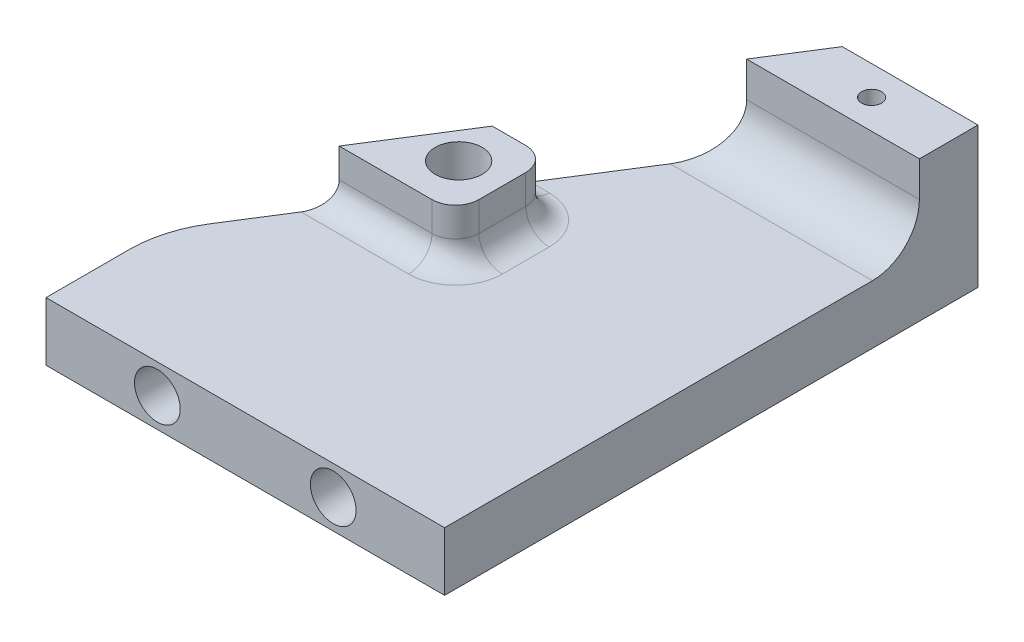
ISO-10303-21;
HEADER;
FILE_DESCRIPTION(('STEP AP214'),'2;1');
FILE_NAME('part.step','',(''),(''),'','','');
FILE_SCHEMA(('AUTOMOTIVE_DESIGN { 1 0 10303 214 1 1 1 1 }'));
ENDSEC;
DATA;
#1=APPLICATION_CONTEXT('core data for automotive mechanical design processes');
#2=APPLICATION_PROTOCOL_DEFINITION('international standard','automotive_design',2000,#1);
#3=PRODUCT_CONTEXT('',#1,'mechanical');
#4=PRODUCT('Part','Part','',(#3));
#5=PRODUCT_RELATED_PRODUCT_CATEGORY('part','',(#4));
#6=PRODUCT_DEFINITION_FORMATION('','',#4);
#7=PRODUCT_DEFINITION_CONTEXT('part definition',#1,'design');
#8=PRODUCT_DEFINITION('design','',#6,#7);
#9=PRODUCT_DEFINITION_SHAPE('','',#8);
#10=(LENGTH_UNIT() NAMED_UNIT(*) SI_UNIT(.MILLI.,.METRE.));
#11=(NAMED_UNIT(*) PLANE_ANGLE_UNIT() SI_UNIT($,.RADIAN.));
#12=(NAMED_UNIT(*) SI_UNIT($,.STERADIAN.) SOLID_ANGLE_UNIT());
#13=UNCERTAINTY_MEASURE_WITH_UNIT(LENGTH_MEASURE(1.E-05),#10,'distance_accuracy_value','');
#14=(GEOMETRIC_REPRESENTATION_CONTEXT(3) GLOBAL_UNCERTAINTY_ASSIGNED_CONTEXT((#13)) GLOBAL_UNIT_ASSIGNED_CONTEXT((#10,
#11,#12)) REPRESENTATION_CONTEXT('',''));
#15=CARTESIAN_POINT('',(0.,0.,0.));
#16=DIRECTION('',(0.,0.,1.));
#17=DIRECTION('',(1.,0.,0.));
#18=AXIS2_PLACEMENT_3D('',#15,#16,#17);
#19=CARTESIAN_POINT('',(0.,-24.5,0.));
#20=DIRECTION('',(0.,1.,0.));
#21=DIRECTION('',(0.,0.,1.));
#22=AXIS2_PLACEMENT_3D('',#19,#20,#21);
#23=PLANE('',#22);
#24=CARTESIAN_POINT('',(4.33263303344278,-24.5,-21.2));
#25=DIRECTION('',(0.,1.,0.));
#26=DIRECTION('',(0.,0.,1.));
#27=AXIS2_PLACEMENT_3D('',#24,#25,#26);
#28=CIRCLE('',#27,4.);
#29=CARTESIAN_POINT('',(8.33263303344278,-24.5,-21.2));
#30=VERTEX_POINT('',#29);
#31=CARTESIAN_POINT('',(4.33263303344277,-24.5,-17.2));
#32=VERTEX_POINT('',#31);
#33=EDGE_CURVE('E286',#30,#32,#28,.F.);
#34=ORIENTED_EDGE('',*,*,#33,.T.);
#35=DIRECTION('',(1.,0.,0.));
#36=VECTOR('',#35,1.);
#37=CARTESIAN_POINT('',(0.,-24.5,-17.2));
#38=LINE('',#37,#36);
#39=CARTESIAN_POINT('',(-4.84242373649306,-24.5,-17.2));
#40=VERTEX_POINT('',#39);
#41=EDGE_CURVE('E292',#32,#40,#38,.F.);
#42=ORIENTED_EDGE('',*,*,#41,.T.);
#43=DIRECTION('',(0.533992991387982,0.,-0.845488903030971));
#44=VECTOR('',#43,1.);
#45=CARTESIAN_POINT('',(-9.38979215754569,-24.5,-10.));
#46=LINE('',#45,#44);
#47=CARTESIAN_POINT('',(-7.8446811878554,-24.5,-12.4464257020096));
#48=VERTEX_POINT('',#47);
#49=EDGE_CURVE('E242',#48,#40,#46,.T.);
#50=ORIENTED_EDGE('',*,*,#49,.F.);
#51=CARTESIAN_POINT('',(0.610207842454307,-24.5,-7.10649578812981));
#52=DIRECTION('',(0.,1.,0.));
#53=DIRECTION('',(0.,0.,1.));
#54=AXIS2_PLACEMENT_3D('',#51,#52,#53);
#55=CIRCLE('',#54,10.);
#56=CARTESIAN_POINT('',(-9.38979215754569,-24.5,-7.10649578812981));
#57=VERTEX_POINT('',#56);
#58=EDGE_CURVE('E276',#48,#57,#55,.T.);
#59=ORIENTED_EDGE('',*,*,#58,.T.);
#60=DIRECTION('',(0.,0.,-1.));
#61=VECTOR('',#60,1.);
#62=CARTESIAN_POINT('',(-9.38979215754569,-24.5,-10.));
#63=LINE('',#62,#61);
#64=CARTESIAN_POINT('',(-9.38979215754569,-24.5,0.));
#65=VERTEX_POINT('',#64);
#66=EDGE_CURVE('E250',#65,#57,#63,.T.);
#67=ORIENTED_EDGE('',*,*,#66,.F.);
#68=DIRECTION('',(1.,0.,0.));
#69=VECTOR('',#68,1.);
#70=CARTESIAN_POINT('',(-9.38979215754569,-24.5,0.));
#71=LINE('',#70,#69);
#72=CARTESIAN_POINT('',(24.6102078424543,-24.5,0.));
#73=VERTEX_POINT('',#72);
#74=EDGE_CURVE('E247',#65,#73,#71,.T.);
#75=ORIENTED_EDGE('',*,*,#74,.T.);
#76=DIRECTION('',(0.,0.,1.));
#77=VECTOR('',#76,1.);
#78=CARTESIAN_POINT('',(24.6102078424543,-24.5,5.));
#79=LINE('',#78,#77);
#80=CARTESIAN_POINT('',(24.6102078424543,-24.5,-36.5));
#81=VERTEX_POINT('',#80);
#82=EDGE_CURVE('E237',#81,#73,#79,.T.);
#83=ORIENTED_EDGE('',*,*,#82,.F.);
#84=DIRECTION('',(1.,0.,0.));
#85=VECTOR('',#84,1.);
#86=CARTESIAN_POINT('',(0.,-24.5,-36.5));
#87=LINE('',#86,#85);
#88=CARTESIAN_POINT('',(7.34704994771747,-24.5,-36.5));
#89=VERTEX_POINT('',#88);
#90=EDGE_CURVE('E263',#81,#89,#87,.F.);
#91=ORIENTED_EDGE('',*,*,#90,.T.);
#92=CARTESIAN_POINT('',(2.73652363192799,-24.5,-29.2));
#93=VERTEX_POINT('',#92);
#94=EDGE_CURVE('E253',#93,#89,#46,.T.);
#95=ORIENTED_EDGE('',*,*,#94,.F.);
#96=DIRECTION('',(-1.,0.,0.));
#97=VECTOR('',#96,1.);
#98=CARTESIAN_POINT('',(0.,-24.5,-29.2));
#99=LINE('',#98,#97);
#100=CARTESIAN_POINT('',(4.33263303344277,-24.5,-29.2));
#101=VERTEX_POINT('',#100);
#102=EDGE_CURVE('E290',#93,#101,#99,.F.);
#103=ORIENTED_EDGE('',*,*,#102,.T.);
#104=CARTESIAN_POINT('',(4.33263303344278,-24.5,-25.2));
#105=DIRECTION('',(0.,1.,0.));
#106=DIRECTION('',(0.,0.,1.));
#107=AXIS2_PLACEMENT_3D('',#104,#105,#106);
#108=CIRCLE('',#107,4.);
#109=CARTESIAN_POINT('',(8.33263303344278,-24.5,-25.2));
#110=VERTEX_POINT('',#109);
#111=EDGE_CURVE('E288',#101,#110,#108,.F.);
#112=ORIENTED_EDGE('',*,*,#111,.T.);
#113=DIRECTION('',(0.,0.,-1.));
#114=VECTOR('',#113,1.);
#115=CARTESIAN_POINT('',(8.33263303344279,-24.5,0.));
#116=LINE('',#115,#114);
#117=EDGE_CURVE('E284',#110,#30,#116,.F.);
#118=ORIENTED_EDGE('',*,*,#117,.T.);
#119=EDGE_LOOP('',(#34,#42,#50,#59,#67,#75,#83,#91,#95,#103,#112,#118));
#120=FACE_BOUND('',#119,.T.);
#121=ADVANCED_FACE('F34',(#120),#23,.T.);
#122=CARTESIAN_POINT('',(-9.38979215754569,4.49999999999999,5.));
#123=DIRECTION('',(1.,0.,0.));
#124=DIRECTION('',(0.,0.,-1.));
#125=AXIS2_PLACEMENT_3D('',#122,#123,#124);
#126=PLANE('',#125);
#127=ORIENTED_EDGE('',*,*,#66,.T.);
#128=DIRECTION('',(0.,1.,0.));
#129=VECTOR('',#128,1.);
#130=CARTESIAN_POINT('',(-9.38979215754569,4.5,-7.1064957881298));
#131=LINE('',#130,#129);
#132=CARTESIAN_POINT('',(-9.38979215754569,-29.5,-7.10649578812981));
#133=VERTEX_POINT('',#132);
#134=EDGE_CURVE('E278',#57,#133,#131,.F.);
#135=ORIENTED_EDGE('',*,*,#134,.T.);
#136=DIRECTION('',(0.,0.,-1.));
#137=VECTOR('',#136,1.);
#138=CARTESIAN_POINT('',(-9.38979215754569,-29.5,-10.));
#139=LINE('',#138,#137);
#140=CARTESIAN_POINT('',(-9.38979215754569,-29.5,0.));
#141=VERTEX_POINT('',#140);
#142=EDGE_CURVE('E241',#141,#133,#139,.T.);
#143=ORIENTED_EDGE('',*,*,#142,.F.);
#144=DIRECTION('',(0.,-1.,0.));
#145=VECTOR('',#144,1.);
#146=CARTESIAN_POINT('',(-9.38979215754569,-29.5,0.));
#147=LINE('',#146,#145);
#148=EDGE_CURVE('E201',#65,#141,#147,.T.);
#149=ORIENTED_EDGE('',*,*,#148,.F.);
#150=EDGE_LOOP('',(#127,#135,#143,#149));
#151=FACE_BOUND('',#150,.T.);
#152=ADVANCED_FACE('F380',(#151),#126,.F.);
#153=CARTESIAN_POINT('',(24.6102078424543,4.5,5.));
#154=DIRECTION('',(-1.,0.,0.));
#155=DIRECTION('',(0.,0.,1.));
#156=AXIS2_PLACEMENT_3D('',#153,#154,#155);
#157=PLANE('',#156);
#158=ORIENTED_EDGE('',*,*,#82,.T.);
#159=DIRECTION('',(0.,-1.,0.));
#160=VECTOR('',#159,1.);
#161=CARTESIAN_POINT('',(24.6102078424543,4.5,0.));
#162=LINE('',#161,#160);
#163=CARTESIAN_POINT('',(24.6102078424543,-29.5,0.));
#164=VERTEX_POINT('',#163);
#165=EDGE_CURVE('E208',#73,#164,#162,.T.);
#166=ORIENTED_EDGE('',*,*,#165,.T.);
#167=DIRECTION('',(0.,0.,1.));
#168=VECTOR('',#167,1.);
#169=CARTESIAN_POINT('',(24.6102078424543,-29.5,5.));
#170=LINE('',#169,#168);
#171=CARTESIAN_POINT('',(24.6102078424543,-29.5,-45.5));
#172=VERTEX_POINT('',#171);
#173=EDGE_CURVE('E238',#172,#164,#170,.T.);
#174=ORIENTED_EDGE('',*,*,#173,.F.);
#175=DIRECTION('',(0.,-1.,0.));
#176=VECTOR('',#175,1.);
#177=CARTESIAN_POINT('',(24.6102078424543,-17.5,-45.5));
#178=LINE('',#177,#176);
#179=CARTESIAN_POINT('',(24.6102078424543,-17.5,-45.5));
#180=VERTEX_POINT('',#179);
#181=EDGE_CURVE('E229',#180,#172,#178,.T.);
#182=ORIENTED_EDGE('',*,*,#181,.F.);
#183=DIRECTION('',(0.,0.,-1.));
#184=VECTOR('',#183,1.);
#185=CARTESIAN_POINT('',(24.6102078424543,-17.5,-45.5));
#186=LINE('',#185,#184);
#187=CARTESIAN_POINT('',(24.6102078424543,-17.5,-40.5));
#188=VERTEX_POINT('',#187);
#189=EDGE_CURVE('E222',#188,#180,#186,.T.);
#190=ORIENTED_EDGE('',*,*,#189,.F.);
#191=DIRECTION('',(0.,-1.,0.));
#192=VECTOR('',#191,1.);
#193=CARTESIAN_POINT('',(24.6102078424543,-17.5,-40.5));
#194=LINE('',#193,#192);
#195=CARTESIAN_POINT('',(24.6102078424543,-20.5,-40.5));
#196=VERTEX_POINT('',#195);
#197=EDGE_CURVE('E231',#188,#196,#194,.T.);
#198=ORIENTED_EDGE('',*,*,#197,.T.);
#199=CARTESIAN_POINT('',(24.6102078424543,-20.5,-36.5));
#200=DIRECTION('',(-1.,0.,0.));
#201=DIRECTION('',(0.,0.,1.));
#202=AXIS2_PLACEMENT_3D('',#199,#200,#201);
#203=CIRCLE('',#202,4.);
#204=EDGE_CURVE('E266',#196,#81,#203,.T.);
#205=ORIENTED_EDGE('',*,*,#204,.T.);
#206=EDGE_LOOP('',(#158,#166,#174,#182,#190,#198,#205));
#207=FACE_BOUND('',#206,.T.);
#208=ADVANCED_FACE('F372',(#207),#157,.F.);
#209=CARTESIAN_POINT('',(-9.38979215754569,-29.5,-10.));
#210=DIRECTION('',(0.845488903030971,0.,0.533992991387982));
#211=DIRECTION('',(0.533992991387982,0.,-0.845488903030971));
#212=AXIS2_PLACEMENT_3D('',#209,#210,#211);
#213=PLANE('',#212);
#214=DIRECTION('',(0.533992991387982,0.,-0.845488903030971));
#215=VECTOR('',#214,1.);
#216=CARTESIAN_POINT('',(-9.38979215754569,-29.5,-10.));
#217=LINE('',#216,#215);
#218=CARTESIAN_POINT('',(-7.8446811878554,-29.5,-12.4464257020096));
#219=VERTEX_POINT('',#218);
#220=CARTESIAN_POINT('',(13.0312604740333,-29.5,-45.5));
#221=VERTEX_POINT('',#220);
#222=EDGE_CURVE('E245',#219,#221,#217,.T.);
#223=ORIENTED_EDGE('',*,*,#222,.F.);
#224=DIRECTION('',(0.,1.,0.));
#225=VECTOR('',#224,1.);
#226=CARTESIAN_POINT('',(-7.8446811878554,-29.5,-12.4464257020096));
#227=LINE('',#226,#225);
#228=EDGE_CURVE('E273',#219,#48,#227,.T.);
#229=ORIENTED_EDGE('',*,*,#228,.T.);
#230=ORIENTED_EDGE('',*,*,#49,.T.);
#231=CARTESIAN_POINT('',(-4.84242373649305,-22.5,-17.2));
#232=DIRECTION('',(0.845488903030971,0.,0.533992991387982));
#233=DIRECTION('',(0.533992991387982,0.,-0.845488903030971));
#234=AXIS2_PLACEMENT_3D('',#231,#232,#233);
#235=ELLIPSE('',#234,2.36549526886781,2.);
#236=CARTESIAN_POINT('',(-3.57926584175621,-22.5,-19.2));
#237=VERTEX_POINT('',#236);
#238=EDGE_CURVE('E43',#40,#237,#235,.T.);
#239=ORIENTED_EDGE('',*,*,#238,.T.);
#240=DIRECTION('',(0.,-1.,0.));
#241=VECTOR('',#240,1.);
#242=CARTESIAN_POINT('',(-3.57926584175621,-20.,-19.2));
#243=LINE('',#242,#241);
#244=CARTESIAN_POINT('',(-3.57926584175621,-20.,-19.2));
#245=VERTEX_POINT('',#244);
#246=EDGE_CURVE('E168',#245,#237,#243,.T.);
#247=ORIENTED_EDGE('',*,*,#246,.F.);
#248=DIRECTION('',(-0.533992991387982,0.,0.845488903030971));
#249=VECTOR('',#248,1.);
#250=CARTESIAN_POINT('',(-3.57926584175621,-20.,-19.2));
#251=LINE('',#250,#249);
#252=CARTESIAN_POINT('',(1.47336573719115,-20.,-27.2));
#253=VERTEX_POINT('',#252);
#254=EDGE_CURVE('E174',#253,#245,#251,.T.);
#255=ORIENTED_EDGE('',*,*,#254,.F.);
#256=DIRECTION('',(0.,-1.,0.));
#257=VECTOR('',#256,1.);
#258=CARTESIAN_POINT('',(1.47336573719115,-20.,-27.2));
#259=LINE('',#258,#257);
#260=CARTESIAN_POINT('',(1.47336573719115,-22.5,-27.2));
#261=VERTEX_POINT('',#260);
#262=EDGE_CURVE('E329',#253,#261,#259,.T.);
#263=ORIENTED_EDGE('',*,*,#262,.T.);
#264=CARTESIAN_POINT('',(2.73652363192799,-22.5,-29.2));
#265=DIRECTION('',(0.845488903030971,0.,0.533992991387982));
#266=DIRECTION('',(-0.533992991387982,0.,0.845488903030971));
#267=AXIS2_PLACEMENT_3D('',#264,#265,#266);
#268=ELLIPSE('',#267,2.36549526886781,2.);
#269=EDGE_CURVE('E11',#261,#93,#268,.T.);
#270=ORIENTED_EDGE('',*,*,#269,.T.);
#271=ORIENTED_EDGE('',*,*,#94,.T.);
#272=CARTESIAN_POINT('',(7.34704994771746,-20.5,-36.5));
#273=DIRECTION('',(0.845488903030971,0.,0.533992991387982));
#274=DIRECTION('',(0.533992991387982,0.,-0.845488903030971));
#275=AXIS2_PLACEMENT_3D('',#272,#273,#274);
#276=ELLIPSE('',#275,4.73099053773563,4.);
#277=CARTESIAN_POINT('',(9.87336573719115,-20.5,-40.5));
#278=VERTEX_POINT('',#277);
#279=EDGE_CURVE('E268',#89,#278,#276,.T.);
#280=ORIENTED_EDGE('',*,*,#279,.T.);
#281=DIRECTION('',(0.,-1.,0.));
#282=VECTOR('',#281,1.);
#283=CARTESIAN_POINT('',(9.87336573719115,-17.5,-40.5));
#284=LINE('',#283,#282);
#285=CARTESIAN_POINT('',(9.87336573719115,-17.5,-40.5));
#286=VERTEX_POINT('',#285);
#287=EDGE_CURVE('E234',#286,#278,#284,.T.);
#288=ORIENTED_EDGE('',*,*,#287,.F.);
#289=DIRECTION('',(-0.533992991387982,0.,0.845488903030971));
#290=VECTOR('',#289,1.);
#291=CARTESIAN_POINT('',(13.0312604740333,-17.5,-45.5));
#292=LINE('',#291,#290);
#293=CARTESIAN_POINT('',(13.0312604740333,-17.5,-45.5));
#294=VERTEX_POINT('',#293);
#295=EDGE_CURVE('E217',#294,#286,#292,.T.);
#296=ORIENTED_EDGE('',*,*,#295,.F.);
#297=DIRECTION('',(0.,-1.,0.));
#298=VECTOR('',#297,1.);
#299=CARTESIAN_POINT('',(13.0312604740333,-17.5,-45.5));
#300=LINE('',#299,#298);
#301=EDGE_CURVE('E226',#294,#221,#300,.T.);
#302=ORIENTED_EDGE('',*,*,#301,.T.);
#303=EDGE_LOOP('',(#223,#229,#230,#239,#247,#255,#263,#270,#271,#280,#288,#296,#302));
#304=FACE_BOUND('',#303,.T.);
#305=ADVANCED_FACE('F186',(#304),#213,.F.);
#306=CARTESIAN_POINT('',(0.,-29.5,0.));
#307=DIRECTION('',(0.,1.,0.));
#308=DIRECTION('',(0.,0.,1.));
#309=AXIS2_PLACEMENT_3D('',#306,#307,#308);
#310=PLANE('',#309);
#311=ORIENTED_EDGE('',*,*,#142,.T.);
#312=CARTESIAN_POINT('',(0.610207842454307,-29.5,-7.10649578812981));
#313=DIRECTION('',(0.,1.,0.));
#314=DIRECTION('',(0.,0.,1.));
#315=AXIS2_PLACEMENT_3D('',#312,#313,#314);
#316=CIRCLE('',#315,10.);
#317=EDGE_CURVE('E280',#133,#219,#316,.F.);
#318=ORIENTED_EDGE('',*,*,#317,.T.);
#319=ORIENTED_EDGE('',*,*,#222,.T.);
#320=DIRECTION('',(1.,0.,0.));
#321=VECTOR('',#320,1.);
#322=CARTESIAN_POINT('',(13.0312604740333,-29.5,-45.5));
#323=LINE('',#322,#321);
#324=EDGE_CURVE('E211',#221,#172,#323,.T.);
#325=ORIENTED_EDGE('',*,*,#324,.T.);
#326=ORIENTED_EDGE('',*,*,#173,.T.);
#327=DIRECTION('',(-1.,0.,0.));
#328=VECTOR('',#327,1.);
#329=CARTESIAN_POINT('',(0.,-29.5,0.));
#330=LINE('',#329,#328);
#331=EDGE_CURVE('E270',#164,#141,#330,.T.);
#332=ORIENTED_EDGE('',*,*,#331,.T.);
#333=EDGE_LOOP('',(#311,#318,#319,#325,#326,#332));
#334=FACE_BOUND('',#333,.T.);
#335=ADVANCED_FACE('F384',(#334),#310,.F.);
#336=CARTESIAN_POINT('',(0.,-17.5,0.));
#337=DIRECTION('',(0.,-1.,0.));
#338=DIRECTION('',(0.,0.,-1.));
#339=AXIS2_PLACEMENT_3D('',#336,#337,#338);
#340=PLANE('',#339);
#341=ORIENTED_EDGE('',*,*,#295,.T.);
#342=DIRECTION('',(1.,0.,0.));
#343=VECTOR('',#342,1.);
#344=CARTESIAN_POINT('',(24.6102078424543,-17.5,-40.5));
#345=LINE('',#344,#343);
#346=EDGE_CURVE('E220',#286,#188,#345,.T.);
#347=ORIENTED_EDGE('',*,*,#346,.T.);
#348=ORIENTED_EDGE('',*,*,#189,.T.);
#349=DIRECTION('',(-1.,0.,0.));
#350=VECTOR('',#349,1.);
#351=CARTESIAN_POINT('',(24.6102078424543,-17.5,-45.5));
#352=LINE('',#351,#350);
#353=EDGE_CURVE('E224',#180,#294,#352,.T.);
#354=ORIENTED_EDGE('',*,*,#353,.T.);
#355=EDGE_LOOP('',(#341,#347,#348,#354));
#356=FACE_BOUND('',#355,.T.);
#357=CARTESIAN_POINT('',(18.0312604740333,-17.5,-43.));
#358=DIRECTION('',(0.,1.,0.));
#359=DIRECTION('',(0.,0.,1.));
#360=AXIS2_PLACEMENT_3D('',#357,#358,#359);
#361=CIRCLE('',#360,0.850000000000001);
#362=CARTESIAN_POINT('',(18.0312604740333,-17.5,-42.15));
#363=VERTEX_POINT('',#362);
#364=EDGE_CURVE('E214',#363,#363,#361,.T.);
#365=ORIENTED_EDGE('',*,*,#364,.F.);
#366=EDGE_LOOP('',(#365));
#367=FACE_BOUND('',#366,.T.);
#368=ADVANCED_FACE('F396',(#356,#367),#340,.F.);
#369=CARTESIAN_POINT('',(24.6102078424543,-17.5,-40.5));
#370=DIRECTION('',(0.,0.,-1.));
#371=DIRECTION('',(-1.,0.,0.));
#372=AXIS2_PLACEMENT_3D('',#369,#370,#371);
#373=PLANE('',#372);
#374=ORIENTED_EDGE('',*,*,#287,.T.);
#375=DIRECTION('',(1.,0.,0.));
#376=VECTOR('',#375,1.);
#377=CARTESIAN_POINT('',(24.6102078424543,-20.5,-40.5));
#378=LINE('',#377,#376);
#379=EDGE_CURVE('E260',#278,#196,#378,.T.);
#380=ORIENTED_EDGE('',*,*,#379,.T.);
#381=ORIENTED_EDGE('',*,*,#197,.F.);
#382=ORIENTED_EDGE('',*,*,#346,.F.);
#383=EDGE_LOOP('',(#374,#380,#381,#382));
#384=FACE_BOUND('',#383,.T.);
#385=ADVANCED_FACE('F368',(#384),#373,.F.);
#386=CARTESIAN_POINT('',(24.6102078424543,-17.5,-45.5));
#387=DIRECTION('',(0.,0.,1.));
#388=DIRECTION('',(1.,0.,0.));
#389=AXIS2_PLACEMENT_3D('',#386,#387,#388);
#390=PLANE('',#389);
#391=ORIENTED_EDGE('',*,*,#181,.T.);
#392=ORIENTED_EDGE('',*,*,#324,.F.);
#393=ORIENTED_EDGE('',*,*,#301,.F.);
#394=ORIENTED_EDGE('',*,*,#353,.F.);
#395=EDGE_LOOP('',(#391,#392,#393,#394));
#396=FACE_BOUND('',#395,.T.);
#397=ADVANCED_FACE('F394',(#396),#390,.F.);
#398=CARTESIAN_POINT('',(18.0312604740333,-17.5,-43.));
#399=DIRECTION('',(0.,-1.,0.));
#400=DIRECTION('',(0.,0.,-1.));
#401=AXIS2_PLACEMENT_3D('',#398,#399,#400);
#402=CYLINDRICAL_SURFACE('',#401,0.850000000000001);
#403=ORIENTED_EDGE('',*,*,#364,.T.);
#404=EDGE_LOOP('',(#403));
#405=FACE_BOUND('',#404,.T.);
#406=CARTESIAN_POINT('',(18.0312604740333,-24.5,-43.));
#407=DIRECTION('',(0.,1.,0.));
#408=DIRECTION('',(0.,0.,1.));
#409=AXIS2_PLACEMENT_3D('',#406,#407,#408);
#410=CIRCLE('',#409,0.850000000000001);
#411=CARTESIAN_POINT('',(18.0312604740333,-24.5,-42.15));
#412=VERTEX_POINT('',#411);
#413=EDGE_CURVE('E257',#412,#412,#410,.F.);
#414=ORIENTED_EDGE('',*,*,#413,.T.);
#415=EDGE_LOOP('',(#414));
#416=FACE_BOUND('',#415,.T.);
#417=ADVANCED_FACE('F402',(#405,#416),#402,.F.);
#418=ORIENTED_EDGE('',*,*,#413,.F.);
#419=EDGE_LOOP('',(#418));
#420=FACE_BOUND('',#419,.T.);
#421=ADVANCED_FACE('F405',(#420),#23,.T.);
#422=CARTESIAN_POINT('',(24.6102078424543,-20.5,-36.5));
#423=DIRECTION('',(1.,0.,0.));
#424=DIRECTION('',(0.,0.,-1.));
#425=AXIS2_PLACEMENT_3D('',#422,#423,#424);
#426=CYLINDRICAL_SURFACE('',#425,4.);
#427=ORIENTED_EDGE('',*,*,#279,.F.);
#428=ORIENTED_EDGE('',*,*,#90,.F.);
#429=ORIENTED_EDGE('',*,*,#204,.F.);
#430=ORIENTED_EDGE('',*,*,#379,.F.);
#431=EDGE_LOOP('',(#427,#428,#429,#430));
#432=FACE_BOUND('',#431,.T.);
#433=ADVANCED_FACE('F370',(#432),#426,.F.);
#434=CARTESIAN_POINT('',(34.6102078424543,-29.5,0.));
#435=DIRECTION('',(0.,0.,-1.));
#436=DIRECTION('',(-1.,0.,0.));
#437=AXIS2_PLACEMENT_3D('',#434,#435,#436);
#438=PLANE('',#437);
#439=CARTESIAN_POINT('',(15.1102078424543,-27.,0.));
#440=DIRECTION('',(0.,0.,1.));
#441=DIRECTION('',(1.,0.,0.));
#442=AXIS2_PLACEMENT_3D('',#439,#440,#441);
#443=CIRCLE('',#442,1.95);
#444=CARTESIAN_POINT('',(17.0602078424543,-27.,0.));
#445=VERTEX_POINT('',#444);
#446=EDGE_CURVE('E202',#445,#445,#443,.T.);
#447=ORIENTED_EDGE('',*,*,#446,.F.);
#448=EDGE_LOOP('',(#447));
#449=FACE_BOUND('',#448,.T.);
#450=CARTESIAN_POINT('',(0.11020784245431,-27.,0.));
#451=DIRECTION('',(0.,0.,1.));
#452=DIRECTION('',(-1.,0.,0.));
#453=AXIS2_PLACEMENT_3D('',#450,#451,#452);
#454=CIRCLE('',#453,1.95);
#455=CARTESIAN_POINT('',(-1.83979215754569,-27.,0.));
#456=VERTEX_POINT('',#455);
#457=EDGE_CURVE('E189',#456,#456,#454,.T.);
#458=ORIENTED_EDGE('',*,*,#457,.F.);
#459=EDGE_LOOP('',(#458));
#460=FACE_BOUND('',#459,.T.);
#461=ORIENTED_EDGE('',*,*,#74,.F.);
#462=ORIENTED_EDGE('',*,*,#148,.T.);
#463=ORIENTED_EDGE('',*,*,#331,.F.);
#464=ORIENTED_EDGE('',*,*,#165,.F.);
#465=EDGE_LOOP('',(#461,#462,#463,#464));
#466=FACE_BOUND('',#465,.T.);
#467=ADVANCED_FACE('F377',(#449,#460,#466),#438,.F.);
#468=CARTESIAN_POINT('',(0.11020784245431,-27.,-6.));
#469=DIRECTION('',(0.,0.,1.));
#470=DIRECTION('',(1.,0.,0.));
#471=AXIS2_PLACEMENT_3D('',#468,#469,#470);
#472=CYLINDRICAL_SURFACE('',#471,1.95);
#473=CARTESIAN_POINT('',(0.11020784245431,-27.,-6.));
#474=DIRECTION('',(0.,0.,1.));
#475=DIRECTION('',(-1.,0.,0.));
#476=AXIS2_PLACEMENT_3D('',#473,#474,#475);
#477=CIRCLE('',#476,1.95);
#478=CARTESIAN_POINT('',(-1.83979215754569,-27.,-6.));
#479=VERTEX_POINT('',#478);
#480=EDGE_CURVE('E192',#479,#479,#477,.T.);
#481=ORIENTED_EDGE('',*,*,#480,.F.);
#482=EDGE_LOOP('',(#481));
#483=FACE_BOUND('',#482,.T.);
#484=ORIENTED_EDGE('',*,*,#457,.T.);
#485=EDGE_LOOP('',(#484));
#486=FACE_BOUND('',#485,.T.);
#487=ADVANCED_FACE('F476',(#483,#486),#472,.F.);
#488=CARTESIAN_POINT('',(0.11020784245431,-27.,-6.));
#489=DIRECTION('',(0.,0.,-1.));
#490=DIRECTION('',(-1.,0.,0.));
#491=AXIS2_PLACEMENT_3D('',#488,#489,#490);
#492=PLANE('',#491);
#493=ORIENTED_EDGE('',*,*,#480,.T.);
#494=EDGE_LOOP('',(#493));
#495=FACE_BOUND('',#494,.T.);
#496=ADVANCED_FACE('F472',(#495),#492,.F.);
#497=CARTESIAN_POINT('',(15.1102078424543,-27.,-6.));
#498=DIRECTION('',(0.,0.,1.));
#499=DIRECTION('',(1.,0.,0.));
#500=AXIS2_PLACEMENT_3D('',#497,#498,#499);
#501=CYLINDRICAL_SURFACE('',#500,1.95);
#502=CARTESIAN_POINT('',(15.1102078424543,-27.,-6.));
#503=DIRECTION('',(0.,0.,1.));
#504=DIRECTION('',(1.,0.,0.));
#505=AXIS2_PLACEMENT_3D('',#502,#503,#504);
#506=CIRCLE('',#505,1.95);
#507=CARTESIAN_POINT('',(17.0602078424543,-27.,-6.));
#508=VERTEX_POINT('',#507);
#509=EDGE_CURVE('E198',#508,#508,#506,.T.);
#510=ORIENTED_EDGE('',*,*,#509,.F.);
#511=EDGE_LOOP('',(#510));
#512=FACE_BOUND('',#511,.T.);
#513=ORIENTED_EDGE('',*,*,#446,.T.);
#514=EDGE_LOOP('',(#513));
#515=FACE_BOUND('',#514,.T.);
#516=ADVANCED_FACE('F468',(#512,#515),#501,.F.);
#517=CARTESIAN_POINT('',(15.1102078424543,-27.,-6.));
#518=DIRECTION('',(0.,0.,1.));
#519=DIRECTION('',(1.,0.,0.));
#520=AXIS2_PLACEMENT_3D('',#517,#518,#519);
#521=PLANE('',#520);
#522=ORIENTED_EDGE('',*,*,#509,.T.);
#523=EDGE_LOOP('',(#522));
#524=FACE_BOUND('',#523,.T.);
#525=ADVANCED_FACE('F429',(#524),#521,.T.);
#526=CARTESIAN_POINT('',(0.610207842454307,-29.5,-7.10649578812981));
#527=DIRECTION('',(0.,1.,0.));
#528=DIRECTION('',(0.,0.,1.));
#529=AXIS2_PLACEMENT_3D('',#526,#527,#528);
#530=CYLINDRICAL_SURFACE('',#529,10.);
#531=ORIENTED_EDGE('',*,*,#317,.F.);
#532=ORIENTED_EDGE('',*,*,#134,.F.);
#533=ORIENTED_EDGE('',*,*,#58,.F.);
#534=ORIENTED_EDGE('',*,*,#228,.F.);
#535=EDGE_LOOP('',(#531,#532,#533,#534));
#536=FACE_BOUND('',#535,.T.);
#537=ADVANCED_FACE('F387',(#536),#530,.T.);
#538=CARTESIAN_POINT('',(4.33263303344277,-20.,-19.2));
#539=DIRECTION('',(0.,0.,-1.));
#540=DIRECTION('',(-1.,0.,0.));
#541=AXIS2_PLACEMENT_3D('',#538,#539,#540);
#542=PLANE('',#541);
#543=ORIENTED_EDGE('',*,*,#246,.T.);
#544=DIRECTION('',(1.,0.,0.));
#545=VECTOR('',#544,1.);
#546=CARTESIAN_POINT('',(4.33263303344277,-22.5,-19.2));
#547=LINE('',#546,#545);
#548=CARTESIAN_POINT('',(4.33263303344277,-22.5,-19.2));
#549=VERTEX_POINT('',#548);
#550=EDGE_CURVE('E282',#237,#549,#547,.T.);
#551=ORIENTED_EDGE('',*,*,#550,.T.);
#552=DIRECTION('',(0.,-1.,0.));
#553=VECTOR('',#552,1.);
#554=CARTESIAN_POINT('',(4.33263303344277,-20.,-19.2));
#555=LINE('',#554,#553);
#556=CARTESIAN_POINT('',(4.33263303344277,-20.,-19.2));
#557=VERTEX_POINT('',#556);
#558=EDGE_CURVE('E170',#557,#549,#555,.T.);
#559=ORIENTED_EDGE('',*,*,#558,.F.);
#560=DIRECTION('',(1.,0.,0.));
#561=VECTOR('',#560,1.);
#562=CARTESIAN_POINT('',(4.33263303344277,-20.,-19.2));
#563=LINE('',#562,#561);
#564=EDGE_CURVE('E163',#245,#557,#563,.T.);
#565=ORIENTED_EDGE('',*,*,#564,.F.);
#566=EDGE_LOOP('',(#543,#551,#559,#565));
#567=FACE_BOUND('',#566,.T.);
#568=ADVANCED_FACE('F165',(#567),#542,.F.);
#569=CARTESIAN_POINT('',(4.33263303344278,-20.,-21.2));
#570=DIRECTION('',(0.,-1.,0.));
#571=DIRECTION('',(0.,0.,-1.));
#572=AXIS2_PLACEMENT_3D('',#569,#570,#571);
#573=CYLINDRICAL_SURFACE('',#572,2.);
#574=ORIENTED_EDGE('',*,*,#558,.T.);
#575=CARTESIAN_POINT('',(4.33263303344278,-22.5,-21.2));
#576=DIRECTION('',(0.,1.,0.));
#577=DIRECTION('',(0.,0.,1.));
#578=AXIS2_PLACEMENT_3D('',#575,#576,#577);
#579=CIRCLE('',#578,2.);
#580=CARTESIAN_POINT('',(6.33263303344278,-22.5,-21.2));
#581=VERTEX_POINT('',#580);
#582=EDGE_CURVE('E51',#549,#581,#579,.T.);
#583=ORIENTED_EDGE('',*,*,#582,.T.);
#584=DIRECTION('',(0.,-1.,0.));
#585=VECTOR('',#584,1.);
#586=CARTESIAN_POINT('',(6.33263303344278,-20.,-21.2));
#587=LINE('',#586,#585);
#588=CARTESIAN_POINT('',(6.33263303344278,-20.,-21.2));
#589=VERTEX_POINT('',#588);
#590=EDGE_CURVE('E194',#589,#581,#587,.T.);
#591=ORIENTED_EDGE('',*,*,#590,.F.);
#592=CARTESIAN_POINT('',(4.33263303344278,-20.,-21.2));
#593=DIRECTION('',(0.,1.,0.));
#594=DIRECTION('',(0.,0.,-1.));
#595=AXIS2_PLACEMENT_3D('',#592,#593,#594);
#596=CIRCLE('',#595,2.);
#597=EDGE_CURVE('E173',#557,#589,#596,.T.);
#598=ORIENTED_EDGE('',*,*,#597,.F.);
#599=EDGE_LOOP('',(#574,#583,#591,#598));
#600=FACE_BOUND('',#599,.T.);
#601=ADVANCED_FACE('F348',(#600),#573,.T.);
#602=CARTESIAN_POINT('',(6.33263303344278,-20.,-25.2));
#603=DIRECTION('',(-1.,0.,0.));
#604=DIRECTION('',(0.,0.,1.));
#605=AXIS2_PLACEMENT_3D('',#602,#603,#604);
#606=PLANE('',#605);
#607=ORIENTED_EDGE('',*,*,#590,.T.);
#608=DIRECTION('',(0.,0.,-1.));
#609=VECTOR('',#608,1.);
#610=CARTESIAN_POINT('',(6.33263303344278,-22.5,-25.2));
#611=LINE('',#610,#609);
#612=CARTESIAN_POINT('',(6.33263303344278,-22.5,-25.2));
#613=VERTEX_POINT('',#612);
#614=EDGE_CURVE('E58',#581,#613,#611,.T.);
#615=ORIENTED_EDGE('',*,*,#614,.T.);
#616=DIRECTION('',(0.,-1.,0.));
#617=VECTOR('',#616,1.);
#618=CARTESIAN_POINT('',(6.33263303344278,-20.,-25.2));
#619=LINE('',#618,#617);
#620=CARTESIAN_POINT('',(6.33263303344278,-20.,-25.2));
#621=VERTEX_POINT('',#620);
#622=EDGE_CURVE('E334',#621,#613,#619,.T.);
#623=ORIENTED_EDGE('',*,*,#622,.F.);
#624=DIRECTION('',(0.,0.,-1.));
#625=VECTOR('',#624,1.);
#626=CARTESIAN_POINT('',(6.33263303344278,-20.,-25.2));
#627=LINE('',#626,#625);
#628=EDGE_CURVE('E324',#589,#621,#627,.T.);
#629=ORIENTED_EDGE('',*,*,#628,.F.);
#630=EDGE_LOOP('',(#607,#615,#623,#629));
#631=FACE_BOUND('',#630,.T.);
#632=ADVANCED_FACE('F336',(#631),#606,.F.);
#633=CARTESIAN_POINT('',(4.33263303344278,-20.,-25.2));
#634=DIRECTION('',(0.,-1.,0.));
#635=DIRECTION('',(0.,0.,-1.));
#636=AXIS2_PLACEMENT_3D('',#633,#634,#635);
#637=CYLINDRICAL_SURFACE('',#636,2.);
#638=ORIENTED_EDGE('',*,*,#622,.T.);
#639=CARTESIAN_POINT('',(4.33263303344278,-22.5,-25.2));
#640=DIRECTION('',(0.,1.,0.));
#641=DIRECTION('',(0.,0.,1.));
#642=AXIS2_PLACEMENT_3D('',#639,#640,#641);
#643=CIRCLE('',#642,2.);
#644=CARTESIAN_POINT('',(4.33263303344277,-22.5,-27.2));
#645=VERTEX_POINT('',#644);
#646=EDGE_CURVE('E296',#613,#645,#643,.T.);
#647=ORIENTED_EDGE('',*,*,#646,.T.);
#648=DIRECTION('',(0.,-1.,0.));
#649=VECTOR('',#648,1.);
#650=CARTESIAN_POINT('',(4.33263303344277,-20.,-27.2));
#651=LINE('',#650,#649);
#652=CARTESIAN_POINT('',(4.33263303344277,-20.,-27.2));
#653=VERTEX_POINT('',#652);
#654=EDGE_CURVE('E331',#653,#645,#651,.T.);
#655=ORIENTED_EDGE('',*,*,#654,.F.);
#656=CARTESIAN_POINT('',(4.33263303344278,-20.,-25.2));
#657=DIRECTION('',(0.,1.,0.));
#658=DIRECTION('',(0.,0.,-1.));
#659=AXIS2_PLACEMENT_3D('',#656,#657,#658);
#660=CIRCLE('',#659,2.);
#661=EDGE_CURVE('E326',#621,#653,#660,.T.);
#662=ORIENTED_EDGE('',*,*,#661,.F.);
#663=EDGE_LOOP('',(#638,#647,#655,#662));
#664=FACE_BOUND('',#663,.T.);
#665=ADVANCED_FACE('F352',(#664),#637,.T.);
#666=CARTESIAN_POINT('',(1.47336573719115,-20.,-27.2));
#667=DIRECTION('',(0.,0.,1.));
#668=DIRECTION('',(1.,0.,0.));
#669=AXIS2_PLACEMENT_3D('',#666,#667,#668);
#670=PLANE('',#669);
#671=ORIENTED_EDGE('',*,*,#654,.T.);
#672=DIRECTION('',(-1.,0.,0.));
#673=VECTOR('',#672,1.);
#674=CARTESIAN_POINT('',(1.47336573719115,-22.5,-27.2));
#675=LINE('',#674,#673);
#676=EDGE_CURVE('E294',#645,#261,#675,.T.);
#677=ORIENTED_EDGE('',*,*,#676,.T.);
#678=ORIENTED_EDGE('',*,*,#262,.F.);
#679=DIRECTION('',(-1.,0.,0.));
#680=VECTOR('',#679,1.);
#681=CARTESIAN_POINT('',(1.47336573719115,-20.,-27.2));
#682=LINE('',#681,#680);
#683=EDGE_CURVE('E179',#653,#253,#682,.T.);
#684=ORIENTED_EDGE('',*,*,#683,.F.);
#685=EDGE_LOOP('',(#671,#677,#678,#684));
#686=FACE_BOUND('',#685,.T.);
#687=ADVANCED_FACE('F355',(#686),#670,.F.);
#688=CARTESIAN_POINT('',(4.33263303344278,-20.,-25.2));
#689=DIRECTION('',(0.,-1.,0.));
#690=DIRECTION('',(0.,0.,-1.));
#691=AXIS2_PLACEMENT_3D('',#688,#689,#690);
#692=PLANE('',#691);
#693=CARTESIAN_POINT('',(2.61020784245431,-20.,-23.2));
#694=DIRECTION('',(0.,-1.,0.));
#695=DIRECTION('',(0.,0.,-1.));
#696=AXIS2_PLACEMENT_3D('',#693,#694,#695);
#697=CIRCLE('',#696,2.);
#698=CARTESIAN_POINT('',(2.61020784245431,-20.,-25.2));
#699=VERTEX_POINT('',#698);
#700=EDGE_CURVE('E311',#699,#699,#697,.T.);
#701=ORIENTED_EDGE('',*,*,#700,.T.);
#702=EDGE_LOOP('',(#701));
#703=FACE_BOUND('',#702,.T.);
#704=ORIENTED_EDGE('',*,*,#254,.T.);
#705=ORIENTED_EDGE('',*,*,#564,.T.);
#706=ORIENTED_EDGE('',*,*,#597,.T.);
#707=ORIENTED_EDGE('',*,*,#628,.T.);
#708=ORIENTED_EDGE('',*,*,#661,.T.);
#709=ORIENTED_EDGE('',*,*,#683,.T.);
#710=EDGE_LOOP('',(#704,#705,#706,#707,#708,#709));
#711=FACE_BOUND('',#710,.T.);
#712=ADVANCED_FACE('F177',(#703,#711),#692,.F.);
#713=CARTESIAN_POINT('',(2.61020784245431,-25.,-23.2));
#714=DIRECTION('',(0.,1.,0.));
#715=DIRECTION('',(0.,0.,1.));
#716=AXIS2_PLACEMENT_3D('',#713,#714,#715);
#717=CYLINDRICAL_SURFACE('',#716,2.);
#718=CARTESIAN_POINT('',(2.61020784245431,-25.,-23.2));
#719=DIRECTION('',(0.,-1.,0.));
#720=DIRECTION('',(0.,0.,-1.));
#721=AXIS2_PLACEMENT_3D('',#718,#719,#720);
#722=CIRCLE('',#721,2.);
#723=CARTESIAN_POINT('',(2.61020784245431,-25.,-25.2));
#724=VERTEX_POINT('',#723);
#725=EDGE_CURVE('E183',#724,#724,#722,.T.);
#726=ORIENTED_EDGE('',*,*,#725,.T.);
#727=EDGE_LOOP('',(#726));
#728=FACE_BOUND('',#727,.T.);
#729=ORIENTED_EDGE('',*,*,#700,.F.);
#730=EDGE_LOOP('',(#729));
#731=FACE_BOUND('',#730,.T.);
#732=ADVANCED_FACE('F444',(#728,#731),#717,.F.);
#733=CARTESIAN_POINT('',(2.61020784245431,-25.,-23.2));
#734=DIRECTION('',(0.,-1.,0.));
#735=DIRECTION('',(0.,0.,-1.));
#736=AXIS2_PLACEMENT_3D('',#733,#734,#735);
#737=PLANE('',#736);
#738=ORIENTED_EDGE('',*,*,#725,.F.);
#739=EDGE_LOOP('',(#738));
#740=FACE_BOUND('',#739,.T.);
#741=ADVANCED_FACE('F440',(#740),#737,.F.);
#742=CARTESIAN_POINT('',(1.47336573719115,-22.5,-29.2));
#743=DIRECTION('',(-1.,0.,0.));
#744=DIRECTION('',(0.,0.,1.));
#745=AXIS2_PLACEMENT_3D('',#742,#743,#744);
#746=CYLINDRICAL_SURFACE('',#745,2.);
#747=ORIENTED_EDGE('',*,*,#269,.F.);
#748=ORIENTED_EDGE('',*,*,#676,.F.);
#749=CARTESIAN_POINT('',(4.33263303344277,-22.5,-29.2));
#750=DIRECTION('',(-1.,0.,0.));
#751=DIRECTION('',(0.,0.,1.));
#752=AXIS2_PLACEMENT_3D('',#749,#750,#751);
#753=CIRCLE('',#752,2.);
#754=EDGE_CURVE('E38',#101,#645,#753,.T.);
#755=ORIENTED_EDGE('',*,*,#754,.F.);
#756=ORIENTED_EDGE('',*,*,#102,.F.);
#757=EDGE_LOOP('',(#747,#748,#755,#756));
#758=FACE_BOUND('',#757,.T.);
#759=ADVANCED_FACE('F36',(#758),#746,.F.);
#760=CARTESIAN_POINT('',(4.33263303344278,-22.5,-25.2));
#761=DIRECTION('',(0.,1.,0.));
#762=DIRECTION('',(0.,0.,1.));
#763=AXIS2_PLACEMENT_3D('',#760,#761,#762);
#764=TOROIDAL_SURFACE('',#763,4.,2.);
#765=ORIENTED_EDGE('',*,*,#754,.T.);
#766=ORIENTED_EDGE('',*,*,#646,.F.);
#767=CARTESIAN_POINT('',(8.33263303344278,-22.5,-25.2));
#768=DIRECTION('',(0.,0.,-1.));
#769=DIRECTION('',(-1.,0.,0.));
#770=AXIS2_PLACEMENT_3D('',#767,#768,#769);
#771=CIRCLE('',#770,2.);
#772=EDGE_CURVE('E305',#110,#613,#771,.T.);
#773=ORIENTED_EDGE('',*,*,#772,.F.);
#774=ORIENTED_EDGE('',*,*,#111,.F.);
#775=EDGE_LOOP('',(#765,#766,#773,#774));
#776=FACE_BOUND('',#775,.T.);
#777=ADVANCED_FACE('F435',(#776),#764,.F.);
#778=CARTESIAN_POINT('',(8.33263303344278,-22.5,-25.2));
#779=DIRECTION('',(0.,0.,-1.));
#780=DIRECTION('',(-1.,0.,0.));
#781=AXIS2_PLACEMENT_3D('',#778,#779,#780);
#782=CYLINDRICAL_SURFACE('',#781,2.);
#783=ORIENTED_EDGE('',*,*,#772,.T.);
#784=ORIENTED_EDGE('',*,*,#614,.F.);
#785=CARTESIAN_POINT('',(8.33263303344278,-22.5,-21.2));
#786=DIRECTION('',(0.,0.,-1.));
#787=DIRECTION('',(-1.,0.,0.));
#788=AXIS2_PLACEMENT_3D('',#785,#786,#787);
#789=CIRCLE('',#788,2.);
#790=EDGE_CURVE('E303',#30,#581,#789,.T.);
#791=ORIENTED_EDGE('',*,*,#790,.F.);
#792=ORIENTED_EDGE('',*,*,#117,.F.);
#793=EDGE_LOOP('',(#783,#784,#791,#792));
#794=FACE_BOUND('',#793,.T.);
#795=ADVANCED_FACE('F338',(#794),#782,.F.);
#796=CARTESIAN_POINT('',(4.33263303344278,-22.5,-21.2));
#797=DIRECTION('',(0.,1.,0.));
#798=DIRECTION('',(0.,0.,1.));
#799=AXIS2_PLACEMENT_3D('',#796,#797,#798);
#800=TOROIDAL_SURFACE('',#799,4.,2.);
#801=ORIENTED_EDGE('',*,*,#790,.T.);
#802=ORIENTED_EDGE('',*,*,#582,.F.);
#803=CARTESIAN_POINT('',(4.33263303344277,-22.5,-17.2));
#804=DIRECTION('',(1.,0.,0.));
#805=DIRECTION('',(0.,0.,-1.));
#806=AXIS2_PLACEMENT_3D('',#803,#804,#805);
#807=CIRCLE('',#806,2.);
#808=EDGE_CURVE('E301',#32,#549,#807,.T.);
#809=ORIENTED_EDGE('',*,*,#808,.F.);
#810=ORIENTED_EDGE('',*,*,#33,.F.);
#811=EDGE_LOOP('',(#801,#802,#809,#810));
#812=FACE_BOUND('',#811,.T.);
#813=ADVANCED_FACE('F341',(#812),#800,.F.);
#814=CARTESIAN_POINT('',(4.33263303344277,-22.5,-17.2));
#815=DIRECTION('',(1.,0.,0.));
#816=DIRECTION('',(0.,0.,-1.));
#817=AXIS2_PLACEMENT_3D('',#814,#815,#816);
#818=CYLINDRICAL_SURFACE('',#817,2.);
#819=ORIENTED_EDGE('',*,*,#238,.F.);
#820=ORIENTED_EDGE('',*,*,#41,.F.);
#821=ORIENTED_EDGE('',*,*,#808,.T.);
#822=ORIENTED_EDGE('',*,*,#550,.F.);
#823=EDGE_LOOP('',(#819,#820,#821,#822));
#824=FACE_BOUND('',#823,.T.);
#825=ADVANCED_FACE('F347',(#824),#818,.F.);
#826=CLOSED_SHELL('',(#121,#152,#208,#305,#335,#368,#385,#397,#417,#421,#433,#467,#487,#496,
#516,#525,#537,#568,#601,#632,#665,#687,#712,#732,#741,#759,#777,#795,#813,#825));
#827=MANIFOLD_SOLID_BREP('B2',#826);
#828=ADVANCED_BREP_SHAPE_REPRESENTATION('',(#18,#827),#14);
#829=SHAPE_DEFINITION_REPRESENTATION(#9,#828);
ENDSEC;
END-ISO-10303-21;
